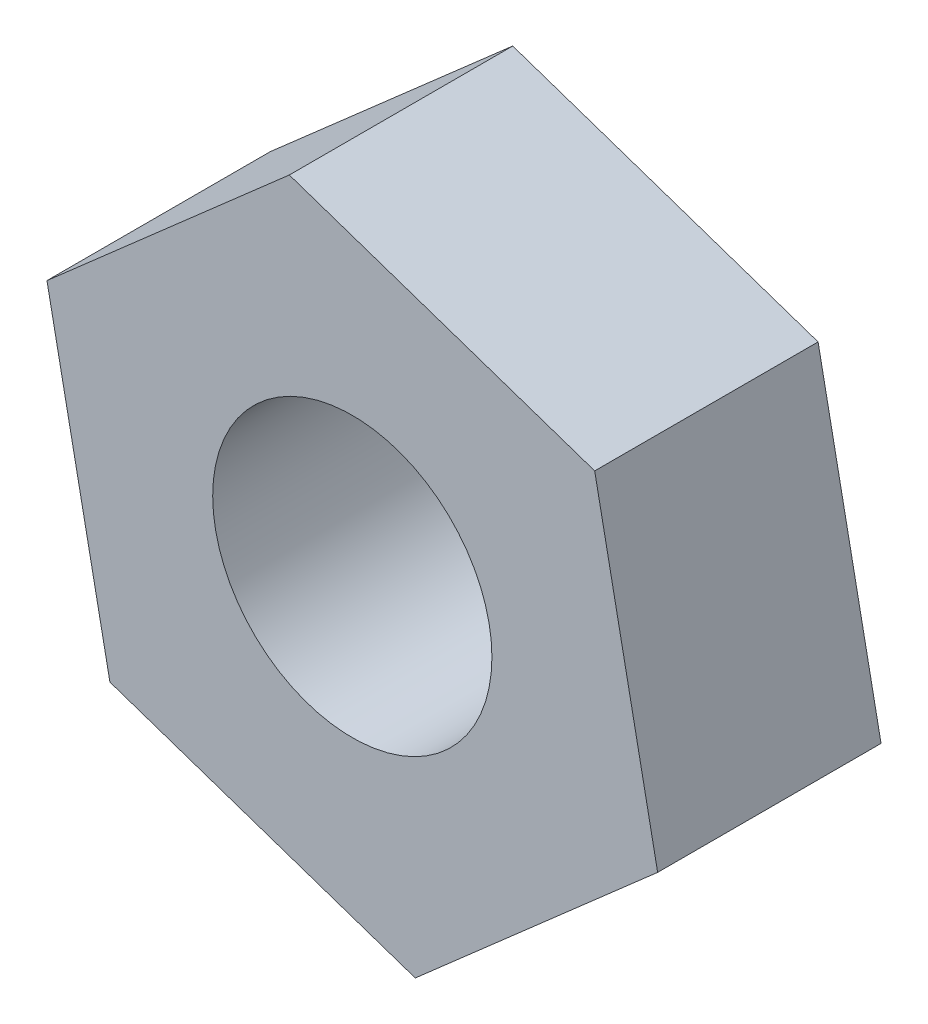
ISO-10303-21;
HEADER;
FILE_DESCRIPTION(('STEP AP214'),'2;1');
FILE_NAME('part.step','',(''),(''),'','','');
FILE_SCHEMA(('AUTOMOTIVE_DESIGN { 1 0 10303 214 1 1 1 1 }'));
ENDSEC;
DATA;
#1=APPLICATION_CONTEXT('core data for automotive mechanical design processes');
#2=APPLICATION_PROTOCOL_DEFINITION('international standard','automotive_design',2000,#1);
#3=PRODUCT_CONTEXT('',#1,'mechanical');
#4=PRODUCT('Part','Part','',(#3));
#5=PRODUCT_RELATED_PRODUCT_CATEGORY('part','',(#4));
#6=PRODUCT_DEFINITION_FORMATION('','',#4);
#7=PRODUCT_DEFINITION_CONTEXT('part definition',#1,'design');
#8=PRODUCT_DEFINITION('design','',#6,#7);
#9=PRODUCT_DEFINITION_SHAPE('','',#8);
#10=(LENGTH_UNIT() NAMED_UNIT(*) SI_UNIT(.MILLI.,.METRE.));
#11=(NAMED_UNIT(*) PLANE_ANGLE_UNIT() SI_UNIT($,.RADIAN.));
#12=(NAMED_UNIT(*) SI_UNIT($,.STERADIAN.) SOLID_ANGLE_UNIT());
#13=UNCERTAINTY_MEASURE_WITH_UNIT(LENGTH_MEASURE(1.E-05),#10,'distance_accuracy_value','');
#14=(GEOMETRIC_REPRESENTATION_CONTEXT(3) GLOBAL_UNCERTAINTY_ASSIGNED_CONTEXT((#13)) GLOBAL_UNIT_ASSIGNED_CONTEXT((#10,
#11,#12)) REPRESENTATION_CONTEXT('',''));
#15=CARTESIAN_POINT('',(0.,0.,0.));
#16=DIRECTION('',(0.,0.,1.));
#17=DIRECTION('',(1.,0.,0.));
#18=AXIS2_PLACEMENT_3D('',#15,#16,#17);
#19=CARTESIAN_POINT('',(0.,0.,2.));
#20=DIRECTION('',(0.,0.,1.));
#21=DIRECTION('',(1.,0.,0.));
#22=AXIS2_PLACEMENT_3D('',#19,#20,#21);
#23=PLANE('',#22);
#24=DIRECTION('',(0.751714336104161,0.659488860327057,0.));
#25=VECTOR('',#24,1.);
#26=CARTESIAN_POINT('',(0.563715965059051,-2.83117601785388,2.));
#27=LINE('',#26,#25);
#28=CARTESIAN_POINT('',(0.563715965059051,-2.83117601785388,2.));
#29=VERTEX_POINT('',#28);
#30=CARTESIAN_POINT('',(2.73372833657624,-0.927395662666948,2.));
#31=VERTEX_POINT('',#30);
#32=EDGE_CURVE('E130',#29,#31,#27,.T.);
#33=ORIENTED_EDGE('',*,*,#32,.T.);
#34=DIRECTION('',(-0.195276938503999,0.980748141618686,0.));
#35=VECTOR('',#34,1.);
#36=CARTESIAN_POINT('',(2.73372833657624,-0.927395662666948,2.));
#37=LINE('',#36,#35);
#38=CARTESIAN_POINT('',(2.17001237151719,1.90378035518693,2.));
#39=VERTEX_POINT('',#38);
#40=EDGE_CURVE('E88',#31,#39,#37,.T.);
#41=ORIENTED_EDGE('',*,*,#40,.T.);
#42=DIRECTION('',(-0.94699127460816,0.321259281291628,0.));
#43=VECTOR('',#42,1.);
#44=CARTESIAN_POINT('',(2.17001237151719,1.90378035518693,2.));
#45=LINE('',#44,#43);
#46=CARTESIAN_POINT('',(-0.563715965059047,2.83117601785386,2.));
#47=VERTEX_POINT('',#46);
#48=EDGE_CURVE('E101',#39,#47,#45,.T.);
#49=ORIENTED_EDGE('',*,*,#48,.T.);
#50=DIRECTION('',(-0.751714336104161,-0.659488860327056,0.));
#51=VECTOR('',#50,1.);
#52=CARTESIAN_POINT('',(-0.563715965059047,2.83117601785386,2.));
#53=LINE('',#52,#51);
#54=CARTESIAN_POINT('',(-2.73372833657624,0.927395662666936,2.));
#55=VERTEX_POINT('',#54);
#56=EDGE_CURVE('E95',#47,#55,#53,.T.);
#57=ORIENTED_EDGE('',*,*,#56,.T.);
#58=DIRECTION('',(0.195276938503998,-0.980748141618686,0.));
#59=VECTOR('',#58,1.);
#60=CARTESIAN_POINT('',(-2.73372833657624,0.927395662666936,2.));
#61=LINE('',#60,#59);
#62=CARTESIAN_POINT('',(-2.17001237151719,-1.90378035518693,2.));
#63=VERTEX_POINT('',#62);
#64=EDGE_CURVE('E99',#55,#63,#61,.T.);
#65=ORIENTED_EDGE('',*,*,#64,.T.);
#66=DIRECTION('',(0.946991274608159,-0.32125928129163,0.));
#67=VECTOR('',#66,1.);
#68=CARTESIAN_POINT('',(-2.17001237151719,-1.90378035518693,2.));
#69=LINE('',#68,#67);
#70=EDGE_CURVE('E51',#63,#29,#69,.T.);
#71=ORIENTED_EDGE('',*,*,#70,.T.);
#72=EDGE_LOOP('',(#33,#41,#49,#57,#65,#71));
#73=FACE_BOUND('',#72,.T.);
#74=CARTESIAN_POINT('',(0.,0.,2.));
#75=DIRECTION('',(0.,0.,1.));
#76=DIRECTION('',(1.,0.,0.));
#77=AXIS2_PLACEMENT_3D('',#74,#75,#76);
#78=CIRCLE('',#77,1.25);
#79=CARTESIAN_POINT('',(1.25,0.,2.));
#80=VERTEX_POINT('',#79);
#81=EDGE_CURVE('E123',#80,#80,#78,.T.);
#82=ORIENTED_EDGE('',*,*,#81,.F.);
#83=EDGE_LOOP('',(#82));
#84=FACE_BOUND('',#83,.T.);
#85=ADVANCED_FACE('F34',(#73,#84),#23,.T.);
#86=CARTESIAN_POINT('',(0.,0.,0.));
#87=DIRECTION('',(0.,0.,1.));
#88=DIRECTION('',(1.,0.,0.));
#89=AXIS2_PLACEMENT_3D('',#86,#87,#88);
#90=PLANE('',#89);
#91=DIRECTION('',(0.751714336104161,0.659488860327057,0.));
#92=VECTOR('',#91,1.);
#93=CARTESIAN_POINT('',(0.563715965059051,-2.83117601785388,0.));
#94=LINE('',#93,#92);
#95=CARTESIAN_POINT('',(0.563715965059051,-2.83117601785388,0.));
#96=VERTEX_POINT('',#95);
#97=CARTESIAN_POINT('',(2.73372833657624,-0.927395662666948,0.));
#98=VERTEX_POINT('',#97);
#99=EDGE_CURVE('E119',#96,#98,#94,.T.);
#100=ORIENTED_EDGE('',*,*,#99,.F.);
#101=DIRECTION('',(0.946991274608159,-0.32125928129163,0.));
#102=VECTOR('',#101,1.);
#103=CARTESIAN_POINT('',(-2.17001237151719,-1.90378035518693,0.));
#104=LINE('',#103,#102);
#105=CARTESIAN_POINT('',(-2.17001237151719,-1.90378035518693,0.));
#106=VERTEX_POINT('',#105);
#107=EDGE_CURVE('E80',#106,#96,#104,.T.);
#108=ORIENTED_EDGE('',*,*,#107,.F.);
#109=DIRECTION('',(0.195276938503998,-0.980748141618686,0.));
#110=VECTOR('',#109,1.);
#111=CARTESIAN_POINT('',(-2.73372833657624,0.927395662666936,0.));
#112=LINE('',#111,#110);
#113=CARTESIAN_POINT('',(-2.73372833657624,0.927395662666936,0.));
#114=VERTEX_POINT('',#113);
#115=EDGE_CURVE('E74',#114,#106,#112,.T.);
#116=ORIENTED_EDGE('',*,*,#115,.F.);
#117=DIRECTION('',(-0.751714336104161,-0.659488860327056,0.));
#118=VECTOR('',#117,1.);
#119=CARTESIAN_POINT('',(-0.563715965059047,2.83117601785386,0.));
#120=LINE('',#119,#118);
#121=CARTESIAN_POINT('',(-0.563715965059047,2.83117601785386,0.));
#122=VERTEX_POINT('',#121);
#123=EDGE_CURVE('E109',#122,#114,#120,.T.);
#124=ORIENTED_EDGE('',*,*,#123,.F.);
#125=DIRECTION('',(-0.94699127460816,0.321259281291628,0.));
#126=VECTOR('',#125,1.);
#127=CARTESIAN_POINT('',(2.17001237151719,1.90378035518693,0.));
#128=LINE('',#127,#126);
#129=CARTESIAN_POINT('',(2.17001237151719,1.90378035518693,0.));
#130=VERTEX_POINT('',#129);
#131=EDGE_CURVE('E125',#130,#122,#128,.T.);
#132=ORIENTED_EDGE('',*,*,#131,.F.);
#133=DIRECTION('',(-0.195276938503999,0.980748141618686,0.));
#134=VECTOR('',#133,1.);
#135=CARTESIAN_POINT('',(2.73372833657624,-0.927395662666948,0.));
#136=LINE('',#135,#134);
#137=EDGE_CURVE('E122',#98,#130,#136,.T.);
#138=ORIENTED_EDGE('',*,*,#137,.F.);
#139=EDGE_LOOP('',(#100,#108,#116,#124,#132,#138));
#140=FACE_BOUND('',#139,.T.);
#141=CARTESIAN_POINT('',(0.,0.,0.));
#142=DIRECTION('',(0.,0.,1.));
#143=DIRECTION('',(1.,0.,0.));
#144=AXIS2_PLACEMENT_3D('',#141,#142,#143);
#145=CIRCLE('',#144,1.25);
#146=CARTESIAN_POINT('',(1.25,0.,0.));
#147=VERTEX_POINT('',#146);
#148=EDGE_CURVE('E223',#147,#147,#145,.T.);
#149=ORIENTED_EDGE('',*,*,#148,.T.);
#150=EDGE_LOOP('',(#149));
#151=FACE_BOUND('',#150,.T.);
#152=ADVANCED_FACE('F139',(#140,#151),#90,.F.);
#153=CARTESIAN_POINT('',(0.563715965059051,-2.83117601785388,2.));
#154=DIRECTION('',(-0.659488860327057,0.751714336104161,0.));
#155=DIRECTION('',(-0.751714336104161,-0.659488860327057,0.));
#156=AXIS2_PLACEMENT_3D('',#153,#154,#155);
#157=PLANE('',#156);
#158=ORIENTED_EDGE('',*,*,#99,.T.);
#159=DIRECTION('',(0.,0.,-1.));
#160=VECTOR('',#159,1.);
#161=CARTESIAN_POINT('',(2.73372833657624,-0.927395662666948,2.));
#162=LINE('',#161,#160);
#163=EDGE_CURVE('E11',#31,#98,#162,.T.);
#164=ORIENTED_EDGE('',*,*,#163,.F.);
#165=ORIENTED_EDGE('',*,*,#32,.F.);
#166=DIRECTION('',(0.,0.,-1.));
#167=VECTOR('',#166,1.);
#168=CARTESIAN_POINT('',(0.563715965059051,-2.83117601785388,2.));
#169=LINE('',#168,#167);
#170=EDGE_CURVE('E115',#29,#96,#169,.T.);
#171=ORIENTED_EDGE('',*,*,#170,.T.);
#172=EDGE_LOOP('',(#158,#164,#165,#171));
#173=FACE_BOUND('',#172,.T.);
#174=ADVANCED_FACE('F36',(#173),#157,.F.);
#175=CARTESIAN_POINT('',(2.73372833657624,-0.927395662666948,2.));
#176=DIRECTION('',(-0.980748141618686,-0.195276938503999,0.));
#177=DIRECTION('',(0.195276938503999,-0.980748141618686,0.));
#178=AXIS2_PLACEMENT_3D('',#175,#176,#177);
#179=PLANE('',#178);
#180=ORIENTED_EDGE('',*,*,#137,.T.);
#181=DIRECTION('',(0.,0.,-1.));
#182=VECTOR('',#181,1.);
#183=CARTESIAN_POINT('',(2.17001237151719,1.90378035518693,2.));
#184=LINE('',#183,#182);
#185=EDGE_CURVE('E43',#39,#130,#184,.T.);
#186=ORIENTED_EDGE('',*,*,#185,.F.);
#187=ORIENTED_EDGE('',*,*,#40,.F.);
#188=ORIENTED_EDGE('',*,*,#163,.T.);
#189=EDGE_LOOP('',(#180,#186,#187,#188));
#190=FACE_BOUND('',#189,.T.);
#191=ADVANCED_FACE('F164',(#190),#179,.F.);
#192=CARTESIAN_POINT('',(2.17001237151719,1.90378035518693,2.));
#193=DIRECTION('',(-0.321259281291628,-0.94699127460816,0.));
#194=DIRECTION('',(0.94699127460816,-0.321259281291628,0.));
#195=AXIS2_PLACEMENT_3D('',#192,#193,#194);
#196=PLANE('',#195);
#197=ORIENTED_EDGE('',*,*,#131,.T.);
#198=DIRECTION('',(0.,0.,-1.));
#199=VECTOR('',#198,1.);
#200=CARTESIAN_POINT('',(-0.563715965059047,2.83117601785386,2.));
#201=LINE('',#200,#199);
#202=EDGE_CURVE('E110',#47,#122,#201,.T.);
#203=ORIENTED_EDGE('',*,*,#202,.F.);
#204=ORIENTED_EDGE('',*,*,#48,.F.);
#205=ORIENTED_EDGE('',*,*,#185,.T.);
#206=EDGE_LOOP('',(#197,#203,#204,#205));
#207=FACE_BOUND('',#206,.T.);
#208=ADVANCED_FACE('F136',(#207),#196,.F.);
#209=CARTESIAN_POINT('',(-0.563715965059047,2.83117601785386,2.));
#210=DIRECTION('',(0.659488860327057,-0.751714336104161,0.));
#211=DIRECTION('',(0.751714336104161,0.659488860327057,0.));
#212=AXIS2_PLACEMENT_3D('',#209,#210,#211);
#213=PLANE('',#212);
#214=ORIENTED_EDGE('',*,*,#123,.T.);
#215=DIRECTION('',(0.,0.,-1.));
#216=VECTOR('',#215,1.);
#217=CARTESIAN_POINT('',(-2.73372833657624,0.927395662666936,2.));
#218=LINE('',#217,#216);
#219=EDGE_CURVE('E106',#55,#114,#218,.T.);
#220=ORIENTED_EDGE('',*,*,#219,.F.);
#221=ORIENTED_EDGE('',*,*,#56,.F.);
#222=ORIENTED_EDGE('',*,*,#202,.T.);
#223=EDGE_LOOP('',(#214,#220,#221,#222));
#224=FACE_BOUND('',#223,.T.);
#225=ADVANCED_FACE('F107',(#224),#213,.F.);
#226=CARTESIAN_POINT('',(-2.73372833657624,0.927395662666936,2.));
#227=DIRECTION('',(0.980748141618686,0.195276938503998,0.));
#228=DIRECTION('',(-0.195276938503998,0.980748141618686,0.));
#229=AXIS2_PLACEMENT_3D('',#226,#227,#228);
#230=PLANE('',#229);
#231=ORIENTED_EDGE('',*,*,#115,.T.);
#232=DIRECTION('',(0.,0.,-1.));
#233=VECTOR('',#232,1.);
#234=CARTESIAN_POINT('',(-2.17001237151719,-1.90378035518693,2.));
#235=LINE('',#234,#233);
#236=EDGE_CURVE('E111',#63,#106,#235,.T.);
#237=ORIENTED_EDGE('',*,*,#236,.F.);
#238=ORIENTED_EDGE('',*,*,#64,.F.);
#239=ORIENTED_EDGE('',*,*,#219,.T.);
#240=EDGE_LOOP('',(#231,#237,#238,#239));
#241=FACE_BOUND('',#240,.T.);
#242=ADVANCED_FACE('F113',(#241),#230,.F.);
#243=CARTESIAN_POINT('',(-2.17001237151719,-1.90378035518693,2.));
#244=DIRECTION('',(0.32125928129163,0.946991274608159,0.));
#245=DIRECTION('',(-0.946991274608159,0.32125928129163,0.));
#246=AXIS2_PLACEMENT_3D('',#243,#244,#245);
#247=PLANE('',#246);
#248=ORIENTED_EDGE('',*,*,#107,.T.);
#249=ORIENTED_EDGE('',*,*,#170,.F.);
#250=ORIENTED_EDGE('',*,*,#70,.F.);
#251=ORIENTED_EDGE('',*,*,#236,.T.);
#252=EDGE_LOOP('',(#248,#249,#250,#251));
#253=FACE_BOUND('',#252,.T.);
#254=ADVANCED_FACE('F144',(#253),#247,.F.);
#255=CARTESIAN_POINT('',(0.,0.,2.));
#256=DIRECTION('',(0.,0.,-1.));
#257=DIRECTION('',(-1.,0.,0.));
#258=AXIS2_PLACEMENT_3D('',#255,#256,#257);
#259=CYLINDRICAL_SURFACE('',#258,1.25);
#260=ORIENTED_EDGE('',*,*,#81,.T.);
#261=EDGE_LOOP('',(#260));
#262=FACE_BOUND('',#261,.T.);
#263=ORIENTED_EDGE('',*,*,#148,.F.);
#264=EDGE_LOOP('',(#263));
#265=FACE_BOUND('',#264,.T.);
#266=ADVANCED_FACE('F146',(#262,#265),#259,.F.);
#267=CLOSED_SHELL('',(#85,#152,#174,#191,#208,#225,#242,#254,#266));
#268=MANIFOLD_SOLID_BREP('B2',#267);
#269=ADVANCED_BREP_SHAPE_REPRESENTATION('',(#18,#268),#14);
#270=SHAPE_DEFINITION_REPRESENTATION(#9,#269);
ENDSEC;
END-ISO-10303-21;
